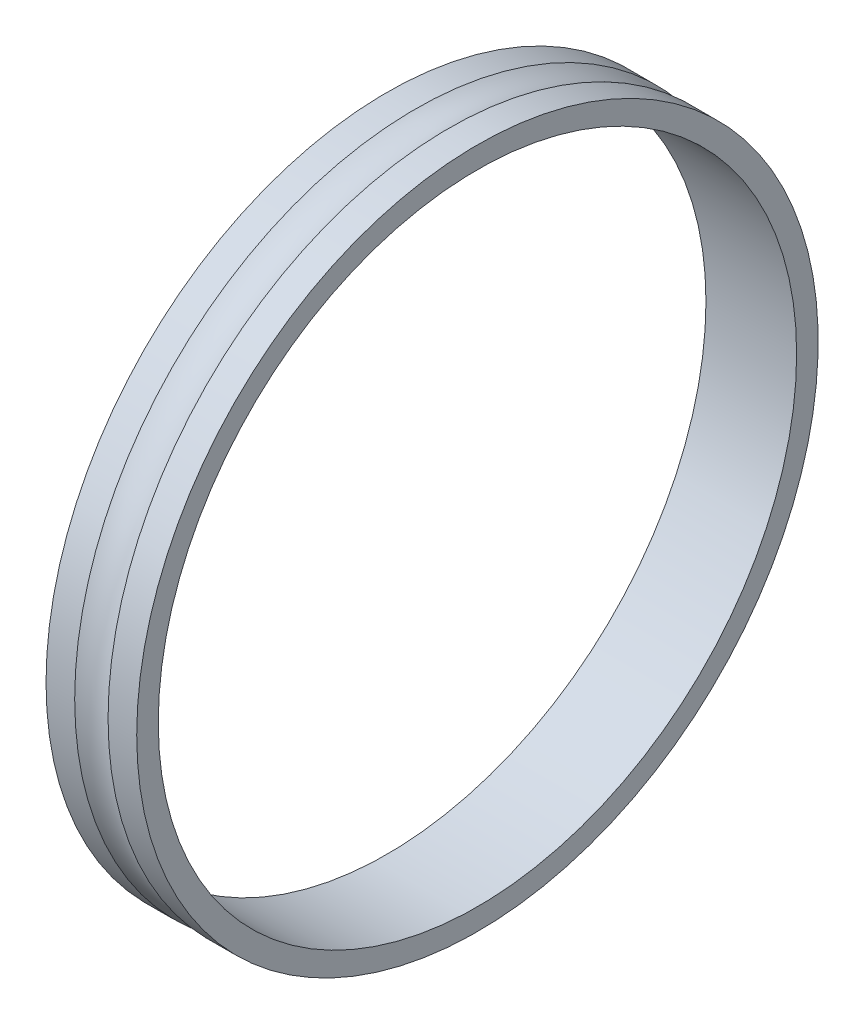
ISO-10303-21;
HEADER;
FILE_DESCRIPTION(('STEP AP214'),'2;1');
FILE_NAME('part.step','',(''),(''),'','','');
FILE_SCHEMA(('AUTOMOTIVE_DESIGN { 1 0 10303 214 1 1 1 1 }'));
ENDSEC;
DATA;
#1=APPLICATION_CONTEXT('core data for automotive mechanical design processes');
#2=APPLICATION_PROTOCOL_DEFINITION('international standard','automotive_design',2000,#1);
#3=PRODUCT_CONTEXT('',#1,'mechanical');
#4=PRODUCT('Part','Part','',(#3));
#5=PRODUCT_RELATED_PRODUCT_CATEGORY('part','',(#4));
#6=PRODUCT_DEFINITION_FORMATION('','',#4);
#7=PRODUCT_DEFINITION_CONTEXT('part definition',#1,'design');
#8=PRODUCT_DEFINITION('design','',#6,#7);
#9=PRODUCT_DEFINITION_SHAPE('','',#8);
#10=(LENGTH_UNIT() NAMED_UNIT(*) SI_UNIT(.MILLI.,.METRE.));
#11=(NAMED_UNIT(*) PLANE_ANGLE_UNIT() SI_UNIT($,.RADIAN.));
#12=(NAMED_UNIT(*) SI_UNIT($,.STERADIAN.) SOLID_ANGLE_UNIT());
#13=UNCERTAINTY_MEASURE_WITH_UNIT(LENGTH_MEASURE(1.E-05),#10,'distance_accuracy_value','');
#14=(GEOMETRIC_REPRESENTATION_CONTEXT(3) GLOBAL_UNCERTAINTY_ASSIGNED_CONTEXT((#13)) GLOBAL_UNIT_ASSIGNED_CONTEXT((#10,
#11,#12)) REPRESENTATION_CONTEXT('',''));
#15=CARTESIAN_POINT('',(0.,0.,0.));
#16=DIRECTION('',(0.,0.,1.));
#17=DIRECTION('',(1.,0.,0.));
#18=AXIS2_PLACEMENT_3D('',#15,#16,#17);
#19=CARTESIAN_POINT('',(57.535,0.,0.));
#20=DIRECTION('',(1.,0.,0.));
#21=DIRECTION('',(0.,0.,-1.));
#22=AXIS2_PLACEMENT_3D('',#19,#20,#21);
#23=TOROIDAL_SURFACE('',#22,61.5315,6.75);
#24=CARTESIAN_POINT('',(60.2463756194965,0.,0.));
#25=DIRECTION('',(-1.,0.,0.));
#26=DIRECTION('',(0.,0.,1.));
#27=AXIS2_PLACEMENT_3D('',#24,#25,#26);
#28=CIRCLE('',#27,55.35);
#29=CARTESIAN_POINT('',(60.2463756194965,0.,55.35));
#30=VERTEX_POINT('',#29);
#31=EDGE_CURVE('E31',#30,#30,#28,.F.);
#32=ORIENTED_EDGE('',*,*,#31,.F.);
#33=EDGE_LOOP('',(#32));
#34=FACE_BOUND('',#33,.T.);
#35=CARTESIAN_POINT('',(54.8236243805035,0.,0.));
#36=DIRECTION('',(-1.,0.,0.));
#37=DIRECTION('',(0.,0.,1.));
#38=AXIS2_PLACEMENT_3D('',#35,#36,#37);
#39=CIRCLE('',#38,55.35);
#40=CARTESIAN_POINT('',(54.8236243805035,0.,55.35));
#41=VERTEX_POINT('',#40);
#42=EDGE_CURVE('E36',#41,#41,#39,.T.);
#43=ORIENTED_EDGE('',*,*,#42,.F.);
#44=EDGE_LOOP('',(#43));
#45=FACE_BOUND('',#44,.T.);
#46=ADVANCED_FACE('F15',(#34,#45),#23,.F.);
#47=CARTESIAN_POINT('',(57.535,0.,0.));
#48=DIRECTION('',(-1.,0.,0.));
#49=DIRECTION('',(0.,0.,1.));
#50=AXIS2_PLACEMENT_3D('',#47,#48,#49);
#51=CYLINDRICAL_SURFACE('',#50,55.35);
#52=CARTESIAN_POINT('',(64.9,0.,0.));
#53=DIRECTION('',(-1.,0.,0.));
#54=DIRECTION('',(0.,0.,1.));
#55=AXIS2_PLACEMENT_3D('',#52,#53,#54);
#56=CIRCLE('',#55,55.35);
#57=CARTESIAN_POINT('',(64.9,0.,55.35));
#58=VERTEX_POINT('',#57);
#59=EDGE_CURVE('E19',#58,#58,#56,.F.);
#60=ORIENTED_EDGE('',*,*,#59,.F.);
#61=EDGE_LOOP('',(#60));
#62=FACE_BOUND('',#61,.T.);
#63=ORIENTED_EDGE('',*,*,#31,.T.);
#64=EDGE_LOOP('',(#63));
#65=FACE_BOUND('',#64,.T.);
#66=ADVANCED_FACE('F47',(#62,#65),#51,.T.);
#67=CARTESIAN_POINT('',(57.535,0.,0.));
#68=DIRECTION('',(-1.,0.,0.));
#69=DIRECTION('',(0.,0.,1.));
#70=AXIS2_PLACEMENT_3D('',#67,#68,#69);
#71=CYLINDRICAL_SURFACE('',#70,55.35);
#72=ORIENTED_EDGE('',*,*,#42,.T.);
#73=EDGE_LOOP('',(#72));
#74=FACE_BOUND('',#73,.T.);
#75=CARTESIAN_POINT('',(50.17,0.,0.));
#76=DIRECTION('',(-1.,0.,0.));
#77=DIRECTION('',(0.,0.,1.));
#78=AXIS2_PLACEMENT_3D('',#75,#76,#77);
#79=CIRCLE('',#78,55.35);
#80=CARTESIAN_POINT('',(50.17,0.,55.35));
#81=VERTEX_POINT('',#80);
#82=EDGE_CURVE('E28',#81,#81,#79,.T.);
#83=ORIENTED_EDGE('',*,*,#82,.F.);
#84=EDGE_LOOP('',(#83));
#85=FACE_BOUND('',#84,.T.);
#86=ADVANCED_FACE('F55',(#74,#85),#71,.T.);
#87=CARTESIAN_POINT('',(64.9,0.,53.6));
#88=DIRECTION('',(1.,0.,0.));
#89=DIRECTION('',(0.,0.,-1.));
#90=AXIS2_PLACEMENT_3D('',#87,#88,#89);
#91=PLANE('',#90);
#92=ORIENTED_EDGE('',*,*,#59,.T.);
#93=EDGE_LOOP('',(#92));
#94=FACE_BOUND('',#93,.T.);
#95=CARTESIAN_POINT('',(64.9,0.,0.));
#96=DIRECTION('',(-1.,0.,0.));
#97=DIRECTION('',(0.,0.,1.));
#98=AXIS2_PLACEMENT_3D('',#95,#96,#97);
#99=CIRCLE('',#98,51.85);
#100=CARTESIAN_POINT('',(64.9,0.,51.85));
#101=VERTEX_POINT('',#100);
#102=EDGE_CURVE('E23',#101,#101,#99,.T.);
#103=ORIENTED_EDGE('',*,*,#102,.T.);
#104=EDGE_LOOP('',(#103));
#105=FACE_BOUND('',#104,.T.);
#106=ADVANCED_FACE('F65',(#94,#105),#91,.T.);
#107=CARTESIAN_POINT('',(50.17,0.,53.6));
#108=DIRECTION('',(-1.,0.,0.));
#109=DIRECTION('',(0.,0.,1.));
#110=AXIS2_PLACEMENT_3D('',#107,#108,#109);
#111=PLANE('',#110);
#112=CARTESIAN_POINT('',(50.17,0.,0.));
#113=DIRECTION('',(-1.,0.,0.));
#114=DIRECTION('',(0.,0.,1.));
#115=AXIS2_PLACEMENT_3D('',#112,#113,#114);
#116=CIRCLE('',#115,51.85);
#117=CARTESIAN_POINT('',(50.17,0.,51.85));
#118=VERTEX_POINT('',#117);
#119=EDGE_CURVE('E10',#118,#118,#116,.F.);
#120=ORIENTED_EDGE('',*,*,#119,.T.);
#121=EDGE_LOOP('',(#120));
#122=FACE_BOUND('',#121,.T.);
#123=ORIENTED_EDGE('',*,*,#82,.T.);
#124=EDGE_LOOP('',(#123));
#125=FACE_BOUND('',#124,.T.);
#126=ADVANCED_FACE('F59',(#122,#125),#111,.T.);
#127=CARTESIAN_POINT('',(57.535,0.,0.));
#128=DIRECTION('',(-1.,0.,0.));
#129=DIRECTION('',(0.,0.,1.));
#130=AXIS2_PLACEMENT_3D('',#127,#128,#129);
#131=CYLINDRICAL_SURFACE('',#130,51.85);
#132=ORIENTED_EDGE('',*,*,#119,.F.);
#133=EDGE_LOOP('',(#132));
#134=FACE_BOUND('',#133,.T.);
#135=ORIENTED_EDGE('',*,*,#102,.F.);
#136=EDGE_LOOP('',(#135));
#137=FACE_BOUND('',#136,.T.);
#138=ADVANCED_FACE('F57',(#134,#137),#131,.F.);
#139=CLOSED_SHELL('',(#46,#66,#86,#106,#126,#138));
#140=MANIFOLD_SOLID_BREP('B1',#139);
#141=ADVANCED_BREP_SHAPE_REPRESENTATION('',(#18,#140),#14);
#142=SHAPE_DEFINITION_REPRESENTATION(#9,#141);
ENDSEC;
END-ISO-10303-21;
